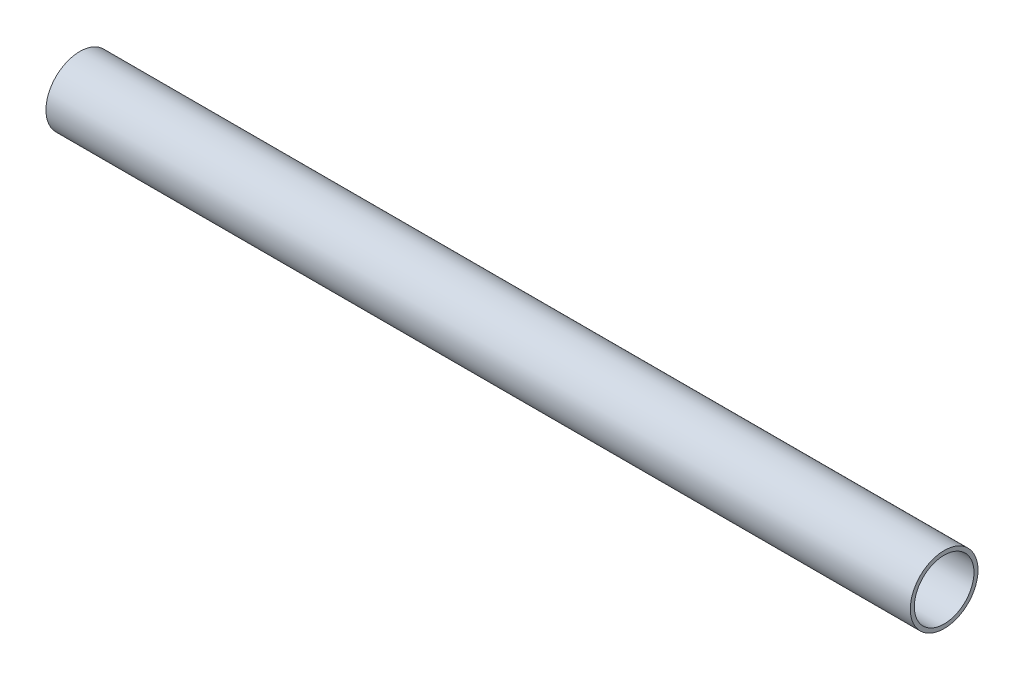
ISO-10303-21;
HEADER;
FILE_DESCRIPTION(('STEP AP214'),'2;1');
FILE_NAME('part.step','',(''),(''),'','','');
FILE_SCHEMA(('AUTOMOTIVE_DESIGN { 1 0 10303 214 1 1 1 1 }'));
ENDSEC;
DATA;
#1=APPLICATION_CONTEXT('core data for automotive mechanical design processes');
#2=APPLICATION_PROTOCOL_DEFINITION('international standard','automotive_design',2000,#1);
#3=PRODUCT_CONTEXT('',#1,'mechanical');
#4=PRODUCT('Part','Part','',(#3));
#5=PRODUCT_RELATED_PRODUCT_CATEGORY('part','',(#4));
#6=PRODUCT_DEFINITION_FORMATION('','',#4);
#7=PRODUCT_DEFINITION_CONTEXT('part definition',#1,'design');
#8=PRODUCT_DEFINITION('design','',#6,#7);
#9=PRODUCT_DEFINITION_SHAPE('','',#8);
#10=(LENGTH_UNIT() NAMED_UNIT(*) SI_UNIT(.MILLI.,.METRE.));
#11=(NAMED_UNIT(*) PLANE_ANGLE_UNIT() SI_UNIT($,.RADIAN.));
#12=(NAMED_UNIT(*) SI_UNIT($,.STERADIAN.) SOLID_ANGLE_UNIT());
#13=UNCERTAINTY_MEASURE_WITH_UNIT(LENGTH_MEASURE(1.E-05),#10,'distance_accuracy_value','');
#14=(GEOMETRIC_REPRESENTATION_CONTEXT(3) GLOBAL_UNCERTAINTY_ASSIGNED_CONTEXT((#13)) GLOBAL_UNIT_ASSIGNED_CONTEXT((#10,
#11,#12)) REPRESENTATION_CONTEXT('',''));
#15=CARTESIAN_POINT('',(0.,0.,0.));
#16=DIRECTION('',(0.,0.,1.));
#17=DIRECTION('',(1.,0.,0.));
#18=AXIS2_PLACEMENT_3D('',#15,#16,#17);
#19=CARTESIAN_POINT('',(1070.,0.,0.));
#20=DIRECTION('',(1.,0.,0.));
#21=DIRECTION('',(0.,0.,-1.));
#22=AXIS2_PLACEMENT_3D('',#19,#20,#21);
#23=PLANE('',#22);
#24=CARTESIAN_POINT('',(1070.,0.,0.));
#25=DIRECTION('',(1.,0.,0.));
#26=DIRECTION('',(0.,0.,-1.));
#27=AXIS2_PLACEMENT_3D('',#24,#25,#26);
#28=CIRCLE('',#27,41.9);
#29=CARTESIAN_POINT('',(1070.,0.,-41.9));
#30=VERTEX_POINT('',#29);
#31=EDGE_CURVE('E10',#30,#30,#28,.T.);
#32=ORIENTED_EDGE('',*,*,#31,.T.);
#33=EDGE_LOOP('',(#32));
#34=FACE_BOUND('',#33,.T.);
#35=CARTESIAN_POINT('',(1070.,0.,0.));
#36=DIRECTION('',(1.,0.,0.));
#37=DIRECTION('',(0.,0.,-1.));
#38=AXIS2_PLACEMENT_3D('',#35,#36,#37);
#39=CIRCLE('',#38,36.9);
#40=CARTESIAN_POINT('',(1070.,0.,-36.9));
#41=VERTEX_POINT('',#40);
#42=EDGE_CURVE('E55',#41,#41,#39,.T.);
#43=ORIENTED_EDGE('',*,*,#42,.F.);
#44=EDGE_LOOP('',(#43));
#45=FACE_BOUND('',#44,.T.);
#46=ADVANCED_FACE('F44',(#34,#45),#23,.T.);
#47=CARTESIAN_POINT('',(0.,0.,0.));
#48=DIRECTION('',(1.,0.,0.));
#49=DIRECTION('',(0.,0.,-1.));
#50=AXIS2_PLACEMENT_3D('',#47,#48,#49);
#51=PLANE('',#50);
#52=CARTESIAN_POINT('',(0.,0.,0.));
#53=DIRECTION('',(1.,0.,0.));
#54=DIRECTION('',(0.,0.,-1.));
#55=AXIS2_PLACEMENT_3D('',#52,#53,#54);
#56=CIRCLE('',#55,41.9);
#57=CARTESIAN_POINT('',(0.,0.,-41.9));
#58=VERTEX_POINT('',#57);
#59=EDGE_CURVE('E48',#58,#58,#56,.T.);
#60=ORIENTED_EDGE('',*,*,#59,.F.);
#61=EDGE_LOOP('',(#60));
#62=FACE_BOUND('',#61,.T.);
#63=CARTESIAN_POINT('',(0.,0.,0.));
#64=DIRECTION('',(1.,0.,0.));
#65=DIRECTION('',(0.,0.,-1.));
#66=AXIS2_PLACEMENT_3D('',#63,#64,#65);
#67=CIRCLE('',#66,36.9);
#68=CARTESIAN_POINT('',(0.,0.,-36.9));
#69=VERTEX_POINT('',#68);
#70=EDGE_CURVE('E57',#69,#69,#67,.T.);
#71=ORIENTED_EDGE('',*,*,#70,.T.);
#72=EDGE_LOOP('',(#71));
#73=FACE_BOUND('',#72,.T.);
#74=ADVANCED_FACE('F67',(#62,#73),#51,.F.);
#75=CARTESIAN_POINT('',(1070.,0.,0.));
#76=DIRECTION('',(-1.,0.,0.));
#77=DIRECTION('',(0.,0.,1.));
#78=AXIS2_PLACEMENT_3D('',#75,#76,#77);
#79=CYLINDRICAL_SURFACE('',#78,41.9);
#80=ORIENTED_EDGE('',*,*,#31,.F.);
#81=EDGE_LOOP('',(#80));
#82=FACE_BOUND('',#81,.T.);
#83=ORIENTED_EDGE('',*,*,#59,.T.);
#84=EDGE_LOOP('',(#83));
#85=FACE_BOUND('',#84,.T.);
#86=ADVANCED_FACE('F46',(#82,#85),#79,.T.);
#87=CARTESIAN_POINT('',(1070.,0.,0.));
#88=DIRECTION('',(-1.,0.,0.));
#89=DIRECTION('',(0.,0.,1.));
#90=AXIS2_PLACEMENT_3D('',#87,#88,#89);
#91=CYLINDRICAL_SURFACE('',#90,36.9);
#92=ORIENTED_EDGE('',*,*,#42,.T.);
#93=EDGE_LOOP('',(#92));
#94=FACE_BOUND('',#93,.T.);
#95=ORIENTED_EDGE('',*,*,#70,.F.);
#96=EDGE_LOOP('',(#95));
#97=FACE_BOUND('',#96,.T.);
#98=ADVANCED_FACE('F63',(#94,#97),#91,.F.);
#99=CLOSED_SHELL('',(#46,#74,#86,#98));
#100=MANIFOLD_SOLID_BREP('B2',#99);
#101=ADVANCED_BREP_SHAPE_REPRESENTATION('',(#18,#100),#14);
#102=SHAPE_DEFINITION_REPRESENTATION(#9,#101);
ENDSEC;
END-ISO-10303-21;
